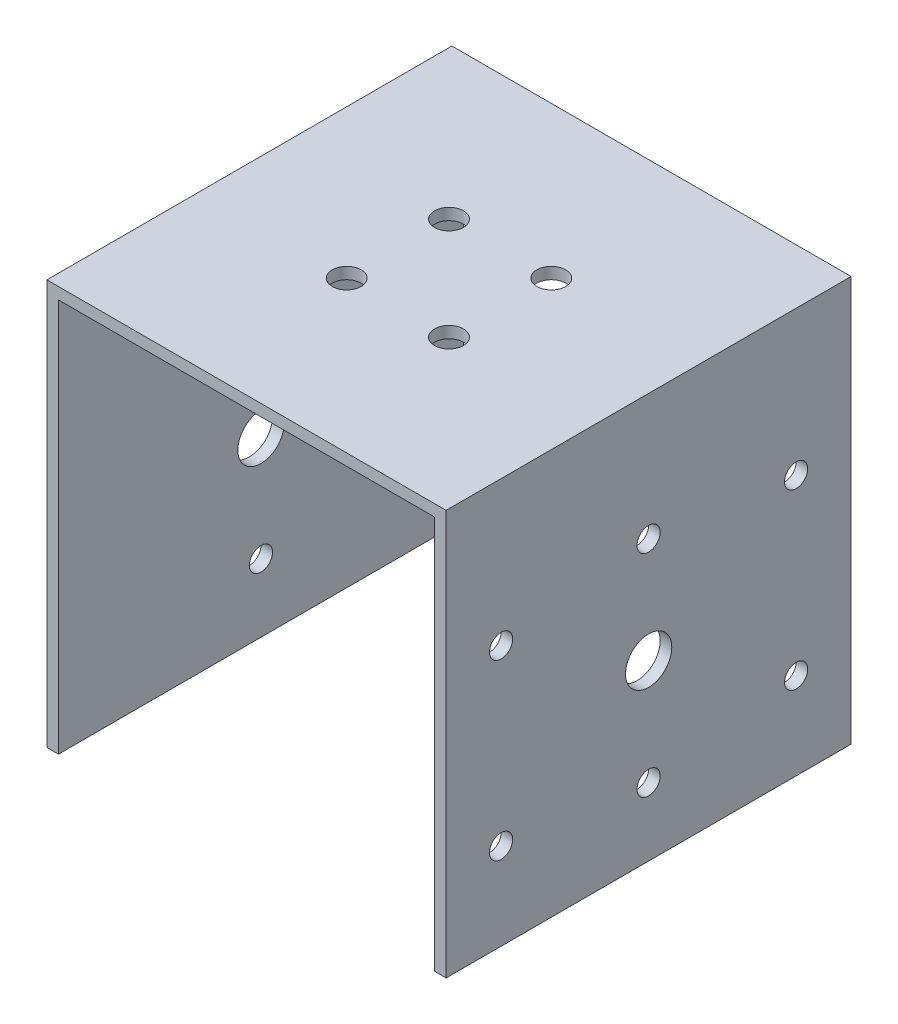
ISO-10303-21;
HEADER;
FILE_DESCRIPTION(('STEP AP214'),'2;1');
FILE_NAME('part.step','',(''),(''),'','','');
FILE_SCHEMA(('AUTOMOTIVE_DESIGN { 1 0 10303 214 1 1 1 1 }'));
ENDSEC;
DATA;
#1=APPLICATION_CONTEXT('core data for automotive mechanical design processes');
#2=APPLICATION_PROTOCOL_DEFINITION('international standard','automotive_design',2000,#1);
#3=PRODUCT_CONTEXT('',#1,'mechanical');
#4=PRODUCT('Part','Part','',(#3));
#5=PRODUCT_RELATED_PRODUCT_CATEGORY('part','',(#4));
#6=PRODUCT_DEFINITION_FORMATION('','',#4);
#7=PRODUCT_DEFINITION_CONTEXT('part definition',#1,'design');
#8=PRODUCT_DEFINITION('design','',#6,#7);
#9=PRODUCT_DEFINITION_SHAPE('','',#8);
#10=(LENGTH_UNIT() NAMED_UNIT(*) SI_UNIT(.MILLI.,.METRE.));
#11=(NAMED_UNIT(*) PLANE_ANGLE_UNIT() SI_UNIT($,.RADIAN.));
#12=(NAMED_UNIT(*) SI_UNIT($,.STERADIAN.) SOLID_ANGLE_UNIT());
#13=UNCERTAINTY_MEASURE_WITH_UNIT(LENGTH_MEASURE(1.E-05),#10,'distance_accuracy_value','');
#14=(GEOMETRIC_REPRESENTATION_CONTEXT(3) GLOBAL_UNCERTAINTY_ASSIGNED_CONTEXT((#13)) GLOBAL_UNIT_ASSIGNED_CONTEXT((#10,
#11,#12)) REPRESENTATION_CONTEXT('',''));
#15=CARTESIAN_POINT('',(0.,0.,0.));
#16=DIRECTION('',(0.,0.,1.));
#17=DIRECTION('',(1.,0.,0.));
#18=AXIS2_PLACEMENT_3D('',#15,#16,#17);
#19=CARTESIAN_POINT('',(-32.,-15.,60.));
#20=DIRECTION('',(0.,1.,0.));
#21=DIRECTION('',(0.,0.,1.));
#22=AXIS2_PLACEMENT_3D('',#19,#20,#21);
#23=PLANE('',#22);
#24=DIRECTION('',(0.,0.,-1.));
#25=VECTOR('',#24,1.);
#26=CARTESIAN_POINT('',(-32.5,-15.,65.));
#27=LINE('',#26,#25);
#28=CARTESIAN_POINT('',(-32.5,-15.,65.));
#29=VERTEX_POINT('',#28);
#30=CARTESIAN_POINT('',(-32.5,-15.,-5.));
#31=VERTEX_POINT('',#30);
#32=EDGE_CURVE('E54',#29,#31,#27,.T.);
#33=ORIENTED_EDGE('',*,*,#32,.F.);
#34=DIRECTION('',(1.,0.,0.));
#35=VECTOR('',#34,1.);
#36=CARTESIAN_POINT('',(-32.,-15.,65.));
#37=LINE('',#36,#35);
#38=CARTESIAN_POINT('',(-34.5,-15.,65.));
#39=VERTEX_POINT('',#38);
#40=EDGE_CURVE('E116',#39,#29,#37,.T.);
#41=ORIENTED_EDGE('',*,*,#40,.F.);
#42=DIRECTION('',(0.,0.,1.));
#43=VECTOR('',#42,1.);
#44=CARTESIAN_POINT('',(-34.5,-15.,-5.));
#45=LINE('',#44,#43);
#46=CARTESIAN_POINT('',(-34.5,-15.,-5.));
#47=VERTEX_POINT('',#46);
#48=EDGE_CURVE('E216',#47,#39,#45,.T.);
#49=ORIENTED_EDGE('',*,*,#48,.F.);
#50=DIRECTION('',(-1.,0.,0.));
#51=VECTOR('',#50,1.);
#52=CARTESIAN_POINT('',(-30.,-15.,-5.));
#53=LINE('',#52,#51);
#54=EDGE_CURVE('E118',#31,#47,#53,.T.);
#55=ORIENTED_EDGE('',*,*,#54,.F.);
#56=EDGE_LOOP('',(#33,#41,#49,#55));
#57=FACE_BOUND('',#56,.T.);
#58=ADVANCED_FACE('F38',(#57),#23,.F.);
#59=CARTESIAN_POINT('',(-32.,15.,30.));
#60=DIRECTION('',(1.,0.,0.));
#61=DIRECTION('',(0.,0.,-1.));
#62=AXIS2_PLACEMENT_3D('',#59,#60,#61);
#63=CYLINDRICAL_SURFACE('',#62,4.);
#64=CARTESIAN_POINT('',(-34.5,15.,30.));
#65=DIRECTION('',(-1.,0.,0.));
#66=DIRECTION('',(0.,0.,1.));
#67=AXIS2_PLACEMENT_3D('',#64,#65,#66);
#68=CIRCLE('',#67,4.);
#69=CARTESIAN_POINT('',(-34.5,15.,34.));
#70=VERTEX_POINT('',#69);
#71=EDGE_CURVE('E206',#70,#70,#68,.T.);
#72=ORIENTED_EDGE('',*,*,#71,.T.);
#73=EDGE_LOOP('',(#72));
#74=FACE_BOUND('',#73,.T.);
#75=CARTESIAN_POINT('',(-32.5,15.,30.));
#76=DIRECTION('',(1.,0.,0.));
#77=DIRECTION('',(0.,0.,-1.));
#78=AXIS2_PLACEMENT_3D('',#75,#76,#77);
#79=CIRCLE('',#78,4.);
#80=CARTESIAN_POINT('',(-32.5,15.,26.));
#81=VERTEX_POINT('',#80);
#82=EDGE_CURVE('E184',#81,#81,#79,.F.);
#83=ORIENTED_EDGE('',*,*,#82,.F.);
#84=EDGE_LOOP('',(#83));
#85=FACE_BOUND('',#84,.T.);
#86=ADVANCED_FACE('F279',(#74,#85),#63,.F.);
#87=CARTESIAN_POINT('',(30.,-15.,60.));
#88=DIRECTION('',(0.,1.,0.));
#89=DIRECTION('',(-1.,0.,0.));
#90=AXIS2_PLACEMENT_3D('',#87,#88,#89);
#91=PLANE('',#90);
#92=DIRECTION('',(0.,0.,1.));
#93=VECTOR('',#92,1.);
#94=CARTESIAN_POINT('',(32.5,-15.,-5.));
#95=LINE('',#94,#93);
#96=CARTESIAN_POINT('',(32.5,-15.,-5.));
#97=VERTEX_POINT('',#96);
#98=CARTESIAN_POINT('',(32.5,-15.,65.));
#99=VERTEX_POINT('',#98);
#100=EDGE_CURVE('E157',#97,#99,#95,.T.);
#101=ORIENTED_EDGE('',*,*,#100,.F.);
#102=DIRECTION('',(-1.,0.,0.));
#103=VECTOR('',#102,1.);
#104=CARTESIAN_POINT('',(32.,-15.,-5.));
#105=LINE('',#104,#103);
#106=CARTESIAN_POINT('',(34.5,-15.,-5.));
#107=VERTEX_POINT('',#106);
#108=EDGE_CURVE('E248',#107,#97,#105,.T.);
#109=ORIENTED_EDGE('',*,*,#108,.F.);
#110=DIRECTION('',(0.,0.,-1.));
#111=VECTOR('',#110,1.);
#112=CARTESIAN_POINT('',(34.5,-15.,65.));
#113=LINE('',#112,#111);
#114=CARTESIAN_POINT('',(34.5,-15.,65.));
#115=VERTEX_POINT('',#114);
#116=EDGE_CURVE('E236',#115,#107,#113,.T.);
#117=ORIENTED_EDGE('',*,*,#116,.F.);
#118=DIRECTION('',(1.,0.,0.));
#119=VECTOR('',#118,1.);
#120=CARTESIAN_POINT('',(30.,-15.,65.));
#121=LINE('',#120,#119);
#122=EDGE_CURVE('E128',#99,#115,#121,.T.);
#123=ORIENTED_EDGE('',*,*,#122,.F.);
#124=EDGE_LOOP('',(#101,#109,#117,#123));
#125=FACE_BOUND('',#124,.T.);
#126=ADVANCED_FACE('F261',(#125),#91,.F.);
#127=CARTESIAN_POINT('',(34.5,15.,30.));
#128=DIRECTION('',(1.,0.,0.));
#129=DIRECTION('',(0.,0.,-1.));
#130=AXIS2_PLACEMENT_3D('',#127,#128,#129);
#131=CIRCLE('',#130,4.);
#132=CARTESIAN_POINT('',(34.5,15.,26.));
#133=VERTEX_POINT('',#132);
#134=EDGE_CURVE('E224',#133,#133,#131,.T.);
#135=ORIENTED_EDGE('',*,*,#134,.T.);
#136=EDGE_LOOP('',(#135));
#137=FACE_BOUND('',#136,.T.);
#138=CARTESIAN_POINT('',(32.5000000000001,15.,30.));
#139=DIRECTION('',(-1.,0.,0.));
#140=DIRECTION('',(0.,-1.,0.));
#141=AXIS2_PLACEMENT_3D('',#138,#139,#140);
#142=CIRCLE('',#141,4.);
#143=CARTESIAN_POINT('',(32.5000000000001,11.,30.));
#144=VERTEX_POINT('',#143);
#145=EDGE_CURVE('E203',#144,#144,#142,.F.);
#146=ORIENTED_EDGE('',*,*,#145,.F.);
#147=EDGE_LOOP('',(#146));
#148=FACE_BOUND('',#147,.T.);
#149=ADVANCED_FACE('F283',(#137,#148),#63,.F.);
#150=CARTESIAN_POINT('',(22.,3.15719672627779E-13,4.50000000000002));
#151=DIRECTION('',(1.,0.,0.));
#152=DIRECTION('',(0.,0.,-1.));
#153=AXIS2_PLACEMENT_3D('',#150,#151,#152);
#154=CYLINDRICAL_SURFACE('',#153,2.);
#155=CARTESIAN_POINT('',(34.5,3.15719672627779E-13,4.50000000000002));
#156=DIRECTION('',(1.,0.,0.));
#157=DIRECTION('',(0.,0.,-1.));
#158=AXIS2_PLACEMENT_3D('',#155,#156,#157);
#159=CIRCLE('',#158,2.);
#160=CARTESIAN_POINT('',(34.5,3.15719672627779E-13,2.50000000000002));
#161=VERTEX_POINT('',#160);
#162=EDGE_CURVE('E221',#161,#161,#159,.T.);
#163=ORIENTED_EDGE('',*,*,#162,.T.);
#164=EDGE_LOOP('',(#163));
#165=FACE_BOUND('',#164,.T.);
#166=CARTESIAN_POINT('',(32.5,3.15719672627779E-13,4.50000000000002));
#167=DIRECTION('',(-1.,0.,0.));
#168=DIRECTION('',(0.,-1.,0.));
#169=AXIS2_PLACEMENT_3D('',#166,#167,#168);
#170=CIRCLE('',#169,2.);
#171=CARTESIAN_POINT('',(32.5,-1.99999999999969,4.50000000000002));
#172=VERTEX_POINT('',#171);
#173=EDGE_CURVE('E200',#172,#172,#170,.F.);
#174=ORIENTED_EDGE('',*,*,#173,.F.);
#175=EDGE_LOOP('',(#174));
#176=FACE_BOUND('',#175,.T.);
#177=ADVANCED_FACE('F323',(#165,#176),#154,.F.);
#178=CARTESIAN_POINT('',(22.,30.0000000000003,55.5));
#179=DIRECTION('',(1.,0.,0.));
#180=DIRECTION('',(0.,0.,-1.));
#181=AXIS2_PLACEMENT_3D('',#178,#179,#180);
#182=CYLINDRICAL_SURFACE('',#181,2.);
#183=CARTESIAN_POINT('',(34.5,30.0000000000003,55.5));
#184=DIRECTION('',(1.,0.,0.));
#185=DIRECTION('',(0.,0.,-1.));
#186=AXIS2_PLACEMENT_3D('',#183,#184,#185);
#187=CIRCLE('',#186,2.);
#188=CARTESIAN_POINT('',(34.5,30.0000000000003,53.5));
#189=VERTEX_POINT('',#188);
#190=EDGE_CURVE('E227',#189,#189,#187,.T.);
#191=ORIENTED_EDGE('',*,*,#190,.T.);
#192=EDGE_LOOP('',(#191));
#193=FACE_BOUND('',#192,.T.);
#194=CARTESIAN_POINT('',(32.5000000000001,30.0000000000003,55.5));
#195=DIRECTION('',(-1.,0.,0.));
#196=DIRECTION('',(0.,-1.,0.));
#197=AXIS2_PLACEMENT_3D('',#194,#195,#196);
#198=CIRCLE('',#197,2.);
#199=CARTESIAN_POINT('',(32.5000000000001,28.0000000000003,55.5));
#200=VERTEX_POINT('',#199);
#201=EDGE_CURVE('E197',#200,#200,#198,.F.);
#202=ORIENTED_EDGE('',*,*,#201,.F.);
#203=EDGE_LOOP('',(#202));
#204=FACE_BOUND('',#203,.T.);
#205=ADVANCED_FACE('F330',(#193,#204),#182,.F.);
#206=CARTESIAN_POINT('',(22.,3.15719672627779E-13,55.5));
#207=DIRECTION('',(1.,0.,0.));
#208=DIRECTION('',(0.,0.,-1.));
#209=AXIS2_PLACEMENT_3D('',#206,#207,#208);
#210=CYLINDRICAL_SURFACE('',#209,2.);
#211=CARTESIAN_POINT('',(34.5,3.15719672627779E-13,55.5));
#212=DIRECTION('',(1.,0.,0.));
#213=DIRECTION('',(0.,0.,-1.));
#214=AXIS2_PLACEMENT_3D('',#211,#212,#213);
#215=CIRCLE('',#214,2.);
#216=CARTESIAN_POINT('',(34.5,3.15719672627779E-13,53.5));
#217=VERTEX_POINT('',#216);
#218=EDGE_CURVE('E230',#217,#217,#215,.T.);
#219=ORIENTED_EDGE('',*,*,#218,.T.);
#220=EDGE_LOOP('',(#219));
#221=FACE_BOUND('',#220,.T.);
#222=CARTESIAN_POINT('',(32.5,3.15719672627779E-13,55.5));
#223=DIRECTION('',(-1.,0.,0.));
#224=DIRECTION('',(0.,-1.,0.));
#225=AXIS2_PLACEMENT_3D('',#222,#223,#224);
#226=CIRCLE('',#225,2.);
#227=CARTESIAN_POINT('',(32.5,-1.99999999999969,55.5));
#228=VERTEX_POINT('',#227);
#229=EDGE_CURVE('E156',#228,#228,#226,.F.);
#230=ORIENTED_EDGE('',*,*,#229,.F.);
#231=EDGE_LOOP('',(#230));
#232=FACE_BOUND('',#231,.T.);
#233=ADVANCED_FACE('F338',(#221,#232),#210,.F.);
#234=CARTESIAN_POINT('',(22.,30.0000000000003,4.50000000000002));
#235=DIRECTION('',(1.,0.,0.));
#236=DIRECTION('',(0.,0.,-1.));
#237=AXIS2_PLACEMENT_3D('',#234,#235,#236);
#238=CYLINDRICAL_SURFACE('',#237,2.00000000000001);
#239=CARTESIAN_POINT('',(34.5,30.0000000000003,4.50000000000002));
#240=DIRECTION('',(1.,0.,0.));
#241=DIRECTION('',(0.,0.,-1.));
#242=AXIS2_PLACEMENT_3D('',#239,#240,#241);
#243=CIRCLE('',#242,2.00000000000001);
#244=CARTESIAN_POINT('',(34.5,30.0000000000003,2.50000000000002));
#245=VERTEX_POINT('',#244);
#246=EDGE_CURVE('E218',#245,#245,#243,.T.);
#247=ORIENTED_EDGE('',*,*,#246,.T.);
#248=EDGE_LOOP('',(#247));
#249=FACE_BOUND('',#248,.T.);
#250=CARTESIAN_POINT('',(32.5000000000001,30.0000000000003,4.50000000000002));
#251=DIRECTION('',(-1.,0.,0.));
#252=DIRECTION('',(0.,-1.,0.));
#253=AXIS2_PLACEMENT_3D('',#250,#251,#252);
#254=CIRCLE('',#253,2.00000000000001);
#255=CARTESIAN_POINT('',(32.5000000000001,28.0000000000003,4.50000000000002));
#256=VERTEX_POINT('',#255);
#257=EDGE_CURVE('E154',#256,#256,#254,.F.);
#258=ORIENTED_EDGE('',*,*,#257,.F.);
#259=EDGE_LOOP('',(#258));
#260=FACE_BOUND('',#259,.T.);
#261=ADVANCED_FACE('F346',(#249,#260),#238,.F.);
#262=CARTESIAN_POINT('',(30.,53.,60.));
#263=DIRECTION('',(0.,1.,0.));
#264=DIRECTION('',(0.,0.,1.));
#265=AXIS2_PLACEMENT_3D('',#262,#263,#264);
#266=PLANE('',#265);
#267=CARTESIAN_POINT('',(8.8388347648318,53.,38.8388347648375));
#268=DIRECTION('',(0.,-1.,0.));
#269=DIRECTION('',(0.,0.,-1.));
#270=AXIS2_PLACEMENT_3D('',#267,#268,#269);
#271=CIRCLE('',#270,2.5);
#272=CARTESIAN_POINT('',(8.8388347648318,53.,36.3388347648375));
#273=VERTEX_POINT('',#272);
#274=EDGE_CURVE('E134',#273,#273,#271,.T.);
#275=ORIENTED_EDGE('',*,*,#274,.F.);
#276=EDGE_LOOP('',(#275));
#277=FACE_BOUND('',#276,.T.);
#278=CARTESIAN_POINT('',(8.83883476483176,53.,21.1611652351738));
#279=DIRECTION('',(0.,-1.,0.));
#280=DIRECTION('',(0.,0.,-1.));
#281=AXIS2_PLACEMENT_3D('',#278,#279,#280);
#282=CIRCLE('',#281,2.50000000000003);
#283=CARTESIAN_POINT('',(8.83883476483176,53.,18.6611652351738));
#284=VERTEX_POINT('',#283);
#285=EDGE_CURVE('E139',#284,#284,#282,.T.);
#286=ORIENTED_EDGE('',*,*,#285,.F.);
#287=EDGE_LOOP('',(#286));
#288=FACE_BOUND('',#287,.T.);
#289=CARTESIAN_POINT('',(-8.83883476483196,53.,21.1611652351739));
#290=DIRECTION('',(0.,-1.,0.));
#291=DIRECTION('',(0.,0.,-1.));
#292=AXIS2_PLACEMENT_3D('',#289,#290,#291);
#293=CIRCLE('',#292,2.50000000000002);
#294=CARTESIAN_POINT('',(-8.83883476483196,53.,18.6611652351738));
#295=VERTEX_POINT('',#294);
#296=EDGE_CURVE('E135',#295,#295,#293,.T.);
#297=ORIENTED_EDGE('',*,*,#296,.F.);
#298=EDGE_LOOP('',(#297));
#299=FACE_BOUND('',#298,.T.);
#300=CARTESIAN_POINT('',(-8.83883476483193,53.,38.8388347648375));
#301=DIRECTION('',(0.,-1.,0.));
#302=DIRECTION('',(0.,0.,-1.));
#303=AXIS2_PLACEMENT_3D('',#300,#301,#302);
#304=CIRCLE('',#303,2.49999999999999);
#305=CARTESIAN_POINT('',(-8.83883476483193,53.,36.3388347648375));
#306=VERTEX_POINT('',#305);
#307=EDGE_CURVE('E138',#306,#306,#304,.T.);
#308=ORIENTED_EDGE('',*,*,#307,.F.);
#309=EDGE_LOOP('',(#308));
#310=FACE_BOUND('',#309,.T.);
#311=DIRECTION('',(1.,0.,0.));
#312=VECTOR('',#311,1.);
#313=CARTESIAN_POINT('',(-30.,53.,65.));
#314=LINE('',#313,#312);
#315=CARTESIAN_POINT('',(-32.5,53.,65.));
#316=VERTEX_POINT('',#315);
#317=CARTESIAN_POINT('',(32.5000000000002,53.,65.));
#318=VERTEX_POINT('',#317);
#319=EDGE_CURVE('E125',#316,#318,#314,.T.);
#320=ORIENTED_EDGE('',*,*,#319,.F.);
#321=DIRECTION('',(0.,0.,1.));
#322=VECTOR('',#321,1.);
#323=CARTESIAN_POINT('',(-32.5,53.,-5.));
#324=LINE('',#323,#322);
#325=CARTESIAN_POINT('',(-32.5,53.,-5.));
#326=VERTEX_POINT('',#325);
#327=EDGE_CURVE('E108',#326,#316,#324,.T.);
#328=ORIENTED_EDGE('',*,*,#327,.F.);
#329=DIRECTION('',(-1.,0.,0.));
#330=VECTOR('',#329,1.);
#331=CARTESIAN_POINT('',(30.,53.,-5.));
#332=LINE('',#331,#330);
#333=CARTESIAN_POINT('',(32.5000000000002,53.,-5.));
#334=VERTEX_POINT('',#333);
#335=EDGE_CURVE('E62',#334,#326,#332,.T.);
#336=ORIENTED_EDGE('',*,*,#335,.F.);
#337=DIRECTION('',(0.,0.,-1.));
#338=VECTOR('',#337,1.);
#339=CARTESIAN_POINT('',(32.5000000000002,53.,65.));
#340=LINE('',#339,#338);
#341=EDGE_CURVE('E190',#318,#334,#340,.T.);
#342=ORIENTED_EDGE('',*,*,#341,.F.);
#343=EDGE_LOOP('',(#320,#328,#336,#342));
#344=FACE_BOUND('',#343,.T.);
#345=ADVANCED_FACE('F253',(#277,#288,#299,#310,#344),#266,.F.);
#346=CARTESIAN_POINT('',(32.,55.,60.));
#347=DIRECTION('',(0.,-1.,0.));
#348=DIRECTION('',(1.,0.,0.));
#349=AXIS2_PLACEMENT_3D('',#346,#347,#348);
#350=PLANE('',#349);
#351=CARTESIAN_POINT('',(8.8388347648318,55.,38.8388347648375));
#352=DIRECTION('',(0.,-1.,0.));
#353=DIRECTION('',(1.,0.,0.));
#354=AXIS2_PLACEMENT_3D('',#351,#352,#353);
#355=CIRCLE('',#354,2.5);
#356=CARTESIAN_POINT('',(11.3388347648318,55.,38.8388347648375));
#357=VERTEX_POINT('',#356);
#358=EDGE_CURVE('E11',#357,#357,#355,.T.);
#359=ORIENTED_EDGE('',*,*,#358,.T.);
#360=EDGE_LOOP('',(#359));
#361=FACE_BOUND('',#360,.T.);
#362=CARTESIAN_POINT('',(8.83883476483176,55.,21.1611652351738));
#363=DIRECTION('',(0.,-1.,0.));
#364=DIRECTION('',(1.,0.,0.));
#365=AXIS2_PLACEMENT_3D('',#362,#363,#364);
#366=CIRCLE('',#365,2.50000000000003);
#367=CARTESIAN_POINT('',(11.3388347648318,55.,21.1611652351738));
#368=VERTEX_POINT('',#367);
#369=EDGE_CURVE('E46',#368,#368,#366,.T.);
#370=ORIENTED_EDGE('',*,*,#369,.T.);
#371=EDGE_LOOP('',(#370));
#372=FACE_BOUND('',#371,.T.);
#373=CARTESIAN_POINT('',(-8.83883476483196,55.,21.1611652351739));
#374=DIRECTION('',(0.,-1.,0.));
#375=DIRECTION('',(1.,0.,0.));
#376=AXIS2_PLACEMENT_3D('',#373,#374,#375);
#377=CIRCLE('',#376,2.50000000000002);
#378=CARTESIAN_POINT('',(-6.33883476483194,55.,21.1611652351739));
#379=VERTEX_POINT('',#378);
#380=EDGE_CURVE('E149',#379,#379,#377,.T.);
#381=ORIENTED_EDGE('',*,*,#380,.T.);
#382=EDGE_LOOP('',(#381));
#383=FACE_BOUND('',#382,.T.);
#384=CARTESIAN_POINT('',(-8.83883476483193,55.,38.8388347648375));
#385=DIRECTION('',(0.,-1.,0.));
#386=DIRECTION('',(1.,0.,0.));
#387=AXIS2_PLACEMENT_3D('',#384,#385,#386);
#388=CIRCLE('',#387,2.49999999999999);
#389=CARTESIAN_POINT('',(-6.33883476483194,55.,38.8388347648375));
#390=VERTEX_POINT('',#389);
#391=EDGE_CURVE('E146',#390,#390,#388,.T.);
#392=ORIENTED_EDGE('',*,*,#391,.T.);
#393=EDGE_LOOP('',(#392));
#394=FACE_BOUND('',#393,.T.);
#395=DIRECTION('',(-1.,0.,0.));
#396=VECTOR('',#395,1.);
#397=CARTESIAN_POINT('',(32.,55.,65.));
#398=LINE('',#397,#396);
#399=CARTESIAN_POINT('',(34.5,55.,65.));
#400=VERTEX_POINT('',#399);
#401=CARTESIAN_POINT('',(-34.5,55.,65.));
#402=VERTEX_POINT('',#401);
#403=EDGE_CURVE('E126',#400,#402,#398,.T.);
#404=ORIENTED_EDGE('',*,*,#403,.F.);
#405=DIRECTION('',(0.,0.,1.));
#406=VECTOR('',#405,1.);
#407=CARTESIAN_POINT('',(34.5,55.,-5.));
#408=LINE('',#407,#406);
#409=CARTESIAN_POINT('',(34.5,55.,-5.));
#410=VERTEX_POINT('',#409);
#411=EDGE_CURVE('E242',#410,#400,#408,.T.);
#412=ORIENTED_EDGE('',*,*,#411,.F.);
#413=DIRECTION('',(1.,0.,0.));
#414=VECTOR('',#413,1.);
#415=CARTESIAN_POINT('',(-32.,55.,-5.));
#416=LINE('',#415,#414);
#417=CARTESIAN_POINT('',(-34.5,55.,-5.));
#418=VERTEX_POINT('',#417);
#419=EDGE_CURVE('E246',#418,#410,#416,.T.);
#420=ORIENTED_EDGE('',*,*,#419,.F.);
#421=DIRECTION('',(0.,0.,-1.));
#422=VECTOR('',#421,1.);
#423=CARTESIAN_POINT('',(-34.5,55.,65.));
#424=LINE('',#423,#422);
#425=EDGE_CURVE('E210',#402,#418,#424,.T.);
#426=ORIENTED_EDGE('',*,*,#425,.F.);
#427=EDGE_LOOP('',(#404,#412,#420,#426));
#428=FACE_BOUND('',#427,.T.);
#429=ADVANCED_FACE('F269',(#361,#372,#383,#394,#428),#350,.F.);
#430=CARTESIAN_POINT('',(-8.83883476483193,63.,38.8388347648375));
#431=DIRECTION('',(0.,-1.,0.));
#432=DIRECTION('',(0.,0.,-1.));
#433=AXIS2_PLACEMENT_3D('',#430,#431,#432);
#434=CYLINDRICAL_SURFACE('',#433,2.49999999999999);
#435=ORIENTED_EDGE('',*,*,#307,.T.);
#436=EDGE_LOOP('',(#435));
#437=FACE_BOUND('',#436,.T.);
#438=ORIENTED_EDGE('',*,*,#391,.F.);
#439=EDGE_LOOP('',(#438));
#440=FACE_BOUND('',#439,.T.);
#441=ADVANCED_FACE('F365',(#437,#440),#434,.F.);
#442=CARTESIAN_POINT('',(-8.83883476483196,63.,21.1611652351739));
#443=DIRECTION('',(0.,-1.,0.));
#444=DIRECTION('',(0.,0.,-1.));
#445=AXIS2_PLACEMENT_3D('',#442,#443,#444);
#446=CYLINDRICAL_SURFACE('',#445,2.50000000000002);
#447=ORIENTED_EDGE('',*,*,#296,.T.);
#448=EDGE_LOOP('',(#447));
#449=FACE_BOUND('',#448,.T.);
#450=ORIENTED_EDGE('',*,*,#380,.F.);
#451=EDGE_LOOP('',(#450));
#452=FACE_BOUND('',#451,.T.);
#453=ADVANCED_FACE('F374',(#449,#452),#446,.F.);
#454=CARTESIAN_POINT('',(8.83883476483176,63.,21.1611652351738));
#455=DIRECTION('',(0.,-1.,0.));
#456=DIRECTION('',(0.,0.,-1.));
#457=AXIS2_PLACEMENT_3D('',#454,#455,#456);
#458=CYLINDRICAL_SURFACE('',#457,2.50000000000003);
#459=ORIENTED_EDGE('',*,*,#285,.T.);
#460=EDGE_LOOP('',(#459));
#461=FACE_BOUND('',#460,.T.);
#462=ORIENTED_EDGE('',*,*,#369,.F.);
#463=EDGE_LOOP('',(#462));
#464=FACE_BOUND('',#463,.T.);
#465=ADVANCED_FACE('F382',(#461,#464),#458,.F.);
#466=CARTESIAN_POINT('',(8.8388347648318,63.,38.8388347648375));
#467=DIRECTION('',(0.,-1.,0.));
#468=DIRECTION('',(0.,0.,-1.));
#469=AXIS2_PLACEMENT_3D('',#466,#467,#468);
#470=CYLINDRICAL_SURFACE('',#469,2.5);
#471=ORIENTED_EDGE('',*,*,#274,.T.);
#472=EDGE_LOOP('',(#471));
#473=FACE_BOUND('',#472,.T.);
#474=ORIENTED_EDGE('',*,*,#358,.F.);
#475=EDGE_LOOP('',(#474));
#476=FACE_BOUND('',#475,.T.);
#477=ADVANCED_FACE('F390',(#473,#476),#470,.F.);
#478=CARTESIAN_POINT('',(0.,0.,65.));
#479=DIRECTION('',(0.,0.,1.));
#480=DIRECTION('',(1.,0.,0.));
#481=AXIS2_PLACEMENT_3D('',#478,#479,#480);
#482=PLANE('',#481);
#483=DIRECTION('',(0.,-1.,0.));
#484=VECTOR('',#483,1.);
#485=CARTESIAN_POINT('',(-32.5,53.,65.));
#486=LINE('',#485,#484);
#487=EDGE_CURVE('E105',#316,#29,#486,.T.);
#488=ORIENTED_EDGE('',*,*,#487,.F.);
#489=ORIENTED_EDGE('',*,*,#319,.T.);
#490=DIRECTION('',(0.,1.,0.));
#491=VECTOR('',#490,1.);
#492=CARTESIAN_POINT('',(32.5,-15.,65.));
#493=LINE('',#492,#491);
#494=EDGE_CURVE('E187',#99,#318,#493,.T.);
#495=ORIENTED_EDGE('',*,*,#494,.F.);
#496=ORIENTED_EDGE('',*,*,#122,.T.);
#497=DIRECTION('',(0.,-1.,0.));
#498=VECTOR('',#497,1.);
#499=CARTESIAN_POINT('',(34.5,55.,65.));
#500=LINE('',#499,#498);
#501=EDGE_CURVE('E233',#400,#115,#500,.T.);
#502=ORIENTED_EDGE('',*,*,#501,.F.);
#503=ORIENTED_EDGE('',*,*,#403,.T.);
#504=DIRECTION('',(0.,1.,0.));
#505=VECTOR('',#504,1.);
#506=CARTESIAN_POINT('',(-34.5,-15.,65.));
#507=LINE('',#506,#505);
#508=EDGE_CURVE('E124',#39,#402,#507,.T.);
#509=ORIENTED_EDGE('',*,*,#508,.F.);
#510=ORIENTED_EDGE('',*,*,#40,.T.);
#511=EDGE_LOOP('',(#488,#489,#495,#496,#502,#503,#509,#510));
#512=FACE_BOUND('',#511,.T.);
#513=ADVANCED_FACE('F122',(#512),#482,.T.);
#514=CARTESIAN_POINT('',(0.,0.,-5.));
#515=DIRECTION('',(0.,0.,-1.));
#516=DIRECTION('',(-1.,0.,0.));
#517=AXIS2_PLACEMENT_3D('',#514,#515,#516);
#518=PLANE('',#517);
#519=ORIENTED_EDGE('',*,*,#335,.T.);
#520=DIRECTION('',(0.,1.,0.));
#521=VECTOR('',#520,1.);
#522=CARTESIAN_POINT('',(-32.5,-15.,-5.));
#523=LINE('',#522,#521);
#524=EDGE_CURVE('E119',#31,#326,#523,.T.);
#525=ORIENTED_EDGE('',*,*,#524,.F.);
#526=ORIENTED_EDGE('',*,*,#54,.T.);
#527=DIRECTION('',(0.,-1.,0.));
#528=VECTOR('',#527,1.);
#529=CARTESIAN_POINT('',(-34.5,55.,-5.));
#530=LINE('',#529,#528);
#531=EDGE_CURVE('E213',#418,#47,#530,.T.);
#532=ORIENTED_EDGE('',*,*,#531,.F.);
#533=ORIENTED_EDGE('',*,*,#419,.T.);
#534=DIRECTION('',(0.,1.,0.));
#535=VECTOR('',#534,1.);
#536=CARTESIAN_POINT('',(34.5,-15.,-5.));
#537=LINE('',#536,#535);
#538=EDGE_CURVE('E239',#107,#410,#537,.T.);
#539=ORIENTED_EDGE('',*,*,#538,.F.);
#540=ORIENTED_EDGE('',*,*,#108,.T.);
#541=DIRECTION('',(0.,-1.,0.));
#542=VECTOR('',#541,1.);
#543=CARTESIAN_POINT('',(32.5000000000002,53.,-5.));
#544=LINE('',#543,#542);
#545=EDGE_CURVE('E192',#334,#97,#544,.T.);
#546=ORIENTED_EDGE('',*,*,#545,.F.);
#547=EDGE_LOOP('',(#519,#525,#526,#532,#533,#539,#540,#546));
#548=FACE_BOUND('',#547,.T.);
#549=ADVANCED_FACE('F252',(#548),#518,.T.);
#550=CARTESIAN_POINT('',(34.5,0.,0.));
#551=DIRECTION('',(1.,0.,0.));
#552=DIRECTION('',(0.,0.,-1.));
#553=AXIS2_PLACEMENT_3D('',#550,#551,#552);
#554=PLANE('',#553);
#555=CARTESIAN_POINT('',(34.5,-3.25000000000001,30.));
#556=DIRECTION('',(1.,0.,0.));
#557=DIRECTION('',(0.,0.,-1.));
#558=AXIS2_PLACEMENT_3D('',#555,#556,#557);
#559=CIRCLE('',#558,2.);
#560=CARTESIAN_POINT('',(34.5,-3.25000000000001,28.));
#561=VERTEX_POINT('',#560);
#562=EDGE_CURVE('E167',#561,#561,#559,.T.);
#563=ORIENTED_EDGE('',*,*,#562,.F.);
#564=EDGE_LOOP('',(#563));
#565=FACE_BOUND('',#564,.T.);
#566=CARTESIAN_POINT('',(34.5,33.25,30.));
#567=DIRECTION('',(1.,0.,0.));
#568=DIRECTION('',(0.,0.,-1.));
#569=AXIS2_PLACEMENT_3D('',#566,#567,#568);
#570=CIRCLE('',#569,2.00000000000001);
#571=CARTESIAN_POINT('',(34.5,33.25,28.));
#572=VERTEX_POINT('',#571);
#573=EDGE_CURVE('E177',#572,#572,#570,.T.);
#574=ORIENTED_EDGE('',*,*,#573,.F.);
#575=EDGE_LOOP('',(#574));
#576=FACE_BOUND('',#575,.T.);
#577=ORIENTED_EDGE('',*,*,#162,.F.);
#578=EDGE_LOOP('',(#577));
#579=FACE_BOUND('',#578,.T.);
#580=ORIENTED_EDGE('',*,*,#190,.F.);
#581=EDGE_LOOP('',(#580));
#582=FACE_BOUND('',#581,.T.);
#583=ORIENTED_EDGE('',*,*,#501,.T.);
#584=ORIENTED_EDGE('',*,*,#116,.T.);
#585=ORIENTED_EDGE('',*,*,#538,.T.);
#586=ORIENTED_EDGE('',*,*,#411,.T.);
#587=EDGE_LOOP('',(#583,#584,#585,#586));
#588=FACE_BOUND('',#587,.T.);
#589=ORIENTED_EDGE('',*,*,#218,.F.);
#590=EDGE_LOOP('',(#589));
#591=FACE_BOUND('',#590,.T.);
#592=ORIENTED_EDGE('',*,*,#134,.F.);
#593=EDGE_LOOP('',(#592));
#594=FACE_BOUND('',#593,.T.);
#595=ORIENTED_EDGE('',*,*,#246,.F.);
#596=EDGE_LOOP('',(#595));
#597=FACE_BOUND('',#596,.T.);
#598=ADVANCED_FACE('F264',(#565,#576,#579,#582,#588,#591,#594,#597),#554,.T.);
#599=CARTESIAN_POINT('',(-34.5,0.,0.));
#600=DIRECTION('',(-1.,0.,0.));
#601=DIRECTION('',(0.,0.,1.));
#602=AXIS2_PLACEMENT_3D('',#599,#600,#601);
#603=PLANE('',#602);
#604=CARTESIAN_POINT('',(-34.5,-3.25000000000001,30.));
#605=DIRECTION('',(1.,0.,0.));
#606=DIRECTION('',(0.,0.,-1.));
#607=AXIS2_PLACEMENT_3D('',#604,#605,#606);
#608=CIRCLE('',#607,2.);
#609=CARTESIAN_POINT('',(-34.5,-3.25000000000001,28.));
#610=VERTEX_POINT('',#609);
#611=EDGE_CURVE('E161',#610,#610,#608,.T.);
#612=ORIENTED_EDGE('',*,*,#611,.T.);
#613=EDGE_LOOP('',(#612));
#614=FACE_BOUND('',#613,.T.);
#615=CARTESIAN_POINT('',(-34.5,33.25,30.));
#616=DIRECTION('',(1.,0.,0.));
#617=DIRECTION('',(0.,0.,-1.));
#618=AXIS2_PLACEMENT_3D('',#615,#616,#617);
#619=CIRCLE('',#618,2.00000000000001);
#620=CARTESIAN_POINT('',(-34.5,33.25,28.));
#621=VERTEX_POINT('',#620);
#622=EDGE_CURVE('E172',#621,#621,#619,.T.);
#623=ORIENTED_EDGE('',*,*,#622,.T.);
#624=EDGE_LOOP('',(#623));
#625=FACE_BOUND('',#624,.T.);
#626=ORIENTED_EDGE('',*,*,#508,.T.);
#627=ORIENTED_EDGE('',*,*,#425,.T.);
#628=ORIENTED_EDGE('',*,*,#531,.T.);
#629=ORIENTED_EDGE('',*,*,#48,.T.);
#630=EDGE_LOOP('',(#626,#627,#628,#629));
#631=FACE_BOUND('',#630,.T.);
#632=ORIENTED_EDGE('',*,*,#71,.F.);
#633=EDGE_LOOP('',(#632));
#634=FACE_BOUND('',#633,.T.);
#635=ADVANCED_FACE('F272',(#614,#625,#631,#634),#603,.T.);
#636=CARTESIAN_POINT('',(32.5,-1.12757025938493E-13,0.));
#637=DIRECTION('',(-1.,0.,0.));
#638=DIRECTION('',(0.,-1.,0.));
#639=AXIS2_PLACEMENT_3D('',#636,#637,#638);
#640=PLANE('',#639);
#641=CARTESIAN_POINT('',(32.5,-3.25000000000001,30.));
#642=DIRECTION('',(-1.,0.,0.));
#643=DIRECTION('',(0.,-1.,0.));
#644=AXIS2_PLACEMENT_3D('',#641,#642,#643);
#645=CIRCLE('',#644,2.);
#646=CARTESIAN_POINT('',(32.5,-5.25000000000001,30.));
#647=VERTEX_POINT('',#646);
#648=EDGE_CURVE('E111',#647,#647,#645,.T.);
#649=ORIENTED_EDGE('',*,*,#648,.F.);
#650=EDGE_LOOP('',(#649));
#651=FACE_BOUND('',#650,.T.);
#652=CARTESIAN_POINT('',(32.5000000000002,33.25,30.));
#653=DIRECTION('',(-1.,0.,0.));
#654=DIRECTION('',(0.,-1.,0.));
#655=AXIS2_PLACEMENT_3D('',#652,#653,#654);
#656=CIRCLE('',#655,2.00000000000001);
#657=CARTESIAN_POINT('',(32.5000000000001,31.25,30.));
#658=VERTEX_POINT('',#657);
#659=EDGE_CURVE('E160',#658,#658,#656,.T.);
#660=ORIENTED_EDGE('',*,*,#659,.F.);
#661=EDGE_LOOP('',(#660));
#662=FACE_BOUND('',#661,.T.);
#663=ORIENTED_EDGE('',*,*,#494,.T.);
#664=ORIENTED_EDGE('',*,*,#341,.T.);
#665=ORIENTED_EDGE('',*,*,#545,.T.);
#666=ORIENTED_EDGE('',*,*,#100,.T.);
#667=EDGE_LOOP('',(#663,#664,#665,#666));
#668=FACE_BOUND('',#667,.T.);
#669=ORIENTED_EDGE('',*,*,#257,.T.);
#670=EDGE_LOOP('',(#669));
#671=FACE_BOUND('',#670,.T.);
#672=ORIENTED_EDGE('',*,*,#229,.T.);
#673=EDGE_LOOP('',(#672));
#674=FACE_BOUND('',#673,.T.);
#675=ORIENTED_EDGE('',*,*,#201,.T.);
#676=EDGE_LOOP('',(#675));
#677=FACE_BOUND('',#676,.T.);
#678=ORIENTED_EDGE('',*,*,#173,.T.);
#679=EDGE_LOOP('',(#678));
#680=FACE_BOUND('',#679,.T.);
#681=ORIENTED_EDGE('',*,*,#145,.T.);
#682=EDGE_LOOP('',(#681));
#683=FACE_BOUND('',#682,.T.);
#684=ADVANCED_FACE('F275',(#651,#662,#668,#671,#674,#677,#680,#683),#640,.T.);
#685=CARTESIAN_POINT('',(-32.5,0.,0.));
#686=DIRECTION('',(1.,0.,0.));
#687=DIRECTION('',(0.,0.,-1.));
#688=AXIS2_PLACEMENT_3D('',#685,#686,#687);
#689=PLANE('',#688);
#690=CARTESIAN_POINT('',(-32.5,-3.25000000000001,30.));
#691=DIRECTION('',(1.,0.,0.));
#692=DIRECTION('',(0.,0.,-1.));
#693=AXIS2_PLACEMENT_3D('',#690,#691,#692);
#694=CIRCLE('',#693,2.);
#695=CARTESIAN_POINT('',(-32.5,-3.25000000000001,28.));
#696=VERTEX_POINT('',#695);
#697=EDGE_CURVE('E41',#696,#696,#694,.T.);
#698=ORIENTED_EDGE('',*,*,#697,.F.);
#699=EDGE_LOOP('',(#698));
#700=FACE_BOUND('',#699,.T.);
#701=CARTESIAN_POINT('',(-32.5,33.25,30.));
#702=DIRECTION('',(1.,0.,0.));
#703=DIRECTION('',(0.,0.,-1.));
#704=AXIS2_PLACEMENT_3D('',#701,#702,#703);
#705=CIRCLE('',#704,2.00000000000001);
#706=CARTESIAN_POINT('',(-32.5,33.25,28.));
#707=VERTEX_POINT('',#706);
#708=EDGE_CURVE('E158',#707,#707,#705,.T.);
#709=ORIENTED_EDGE('',*,*,#708,.F.);
#710=EDGE_LOOP('',(#709));
#711=FACE_BOUND('',#710,.T.);
#712=ORIENTED_EDGE('',*,*,#487,.T.);
#713=ORIENTED_EDGE('',*,*,#32,.T.);
#714=ORIENTED_EDGE('',*,*,#524,.T.);
#715=ORIENTED_EDGE('',*,*,#327,.T.);
#716=EDGE_LOOP('',(#712,#713,#714,#715));
#717=FACE_BOUND('',#716,.T.);
#718=ORIENTED_EDGE('',*,*,#82,.T.);
#719=EDGE_LOOP('',(#718));
#720=FACE_BOUND('',#719,.T.);
#721=ADVANCED_FACE('F106',(#700,#711,#717,#720),#689,.T.);
#722=CARTESIAN_POINT('',(-34.5,33.25,30.));
#723=DIRECTION('',(1.,0.,0.));
#724=DIRECTION('',(0.,0.,-1.));
#725=AXIS2_PLACEMENT_3D('',#722,#723,#724);
#726=CYLINDRICAL_SURFACE('',#725,2.00000000000001);
#727=ORIENTED_EDGE('',*,*,#708,.T.);
#728=EDGE_LOOP('',(#727));
#729=FACE_BOUND('',#728,.T.);
#730=ORIENTED_EDGE('',*,*,#622,.F.);
#731=EDGE_LOOP('',(#730));
#732=FACE_BOUND('',#731,.T.);
#733=ADVANCED_FACE('F286',(#729,#732),#726,.F.);
#734=CARTESIAN_POINT('',(-34.5,-3.25000000000001,30.));
#735=DIRECTION('',(1.,0.,0.));
#736=DIRECTION('',(0.,0.,-1.));
#737=AXIS2_PLACEMENT_3D('',#734,#735,#736);
#738=CYLINDRICAL_SURFACE('',#737,2.);
#739=ORIENTED_EDGE('',*,*,#697,.T.);
#740=EDGE_LOOP('',(#739));
#741=FACE_BOUND('',#740,.T.);
#742=ORIENTED_EDGE('',*,*,#611,.F.);
#743=EDGE_LOOP('',(#742));
#744=FACE_BOUND('',#743,.T.);
#745=ADVANCED_FACE('F294',(#741,#744),#738,.F.);
#746=ORIENTED_EDGE('',*,*,#659,.T.);
#747=EDGE_LOOP('',(#746));
#748=FACE_BOUND('',#747,.T.);
#749=ORIENTED_EDGE('',*,*,#573,.T.);
#750=EDGE_LOOP('',(#749));
#751=FACE_BOUND('',#750,.T.);
#752=ADVANCED_FACE('F296',(#748,#751),#726,.F.);
#753=ORIENTED_EDGE('',*,*,#648,.T.);
#754=EDGE_LOOP('',(#753));
#755=FACE_BOUND('',#754,.T.);
#756=ORIENTED_EDGE('',*,*,#562,.T.);
#757=EDGE_LOOP('',(#756));
#758=FACE_BOUND('',#757,.T.);
#759=ADVANCED_FACE('F449',(#755,#758),#738,.F.);
#760=CLOSED_SHELL('',(#58,#86,#126,#149,#177,#205,#233,#261,#345,#429,#441,#453,#465,#477,#513,
#549,#598,#635,#684,#721,#733,#745,#752,#759));
#761=MANIFOLD_SOLID_BREP('B2',#760);
#762=ADVANCED_BREP_SHAPE_REPRESENTATION('',(#18,#761),#14);
#763=SHAPE_DEFINITION_REPRESENTATION(#9,#762);
ENDSEC;
END-ISO-10303-21;
